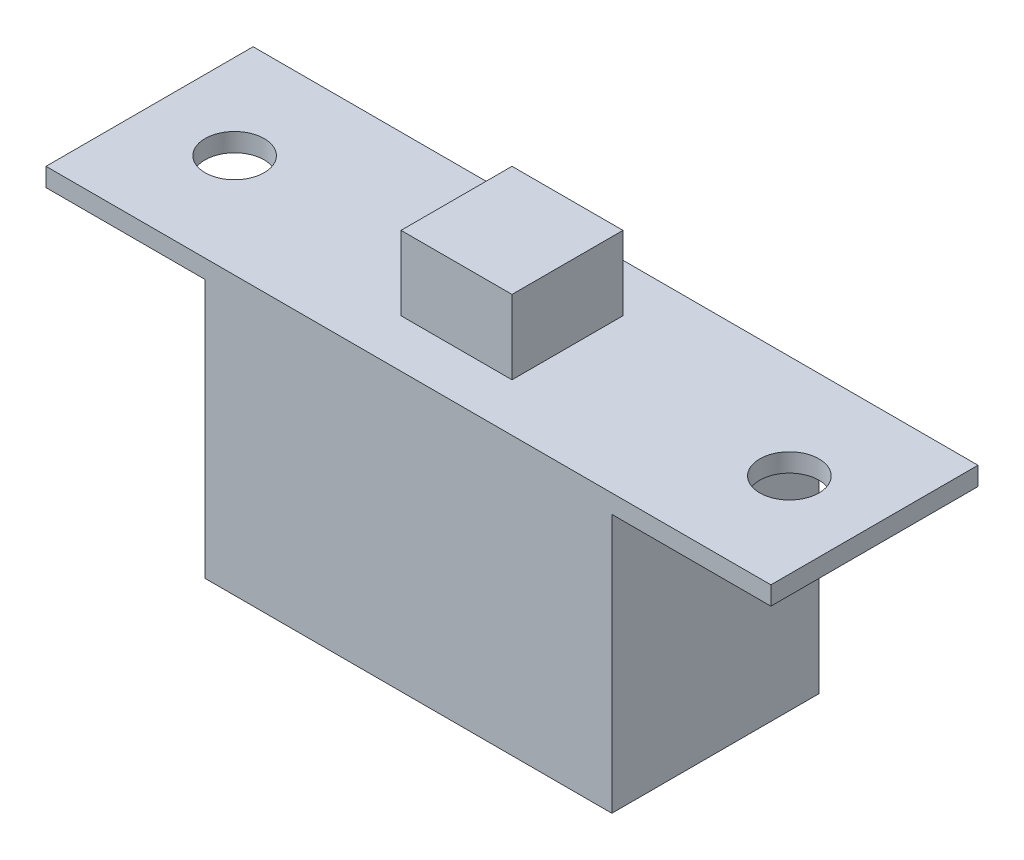
ISO-10303-21;
HEADER;
FILE_DESCRIPTION(('STEP AP214'),'2;1');
FILE_NAME('part.step','',(''),(''),'','','');
FILE_SCHEMA(('AUTOMOTIVE_DESIGN { 1 0 10303 214 1 1 1 1 }'));
ENDSEC;
DATA;
#1=APPLICATION_CONTEXT('core data for automotive mechanical design processes');
#2=APPLICATION_PROTOCOL_DEFINITION('international standard','automotive_design',2000,#1);
#3=PRODUCT_CONTEXT('',#1,'mechanical');
#4=PRODUCT('Part','Part','',(#3));
#5=PRODUCT_RELATED_PRODUCT_CATEGORY('part','',(#4));
#6=PRODUCT_DEFINITION_FORMATION('','',#4);
#7=PRODUCT_DEFINITION_CONTEXT('part definition',#1,'design');
#8=PRODUCT_DEFINITION('design','',#6,#7);
#9=PRODUCT_DEFINITION_SHAPE('','',#8);
#10=(LENGTH_UNIT() NAMED_UNIT(*) SI_UNIT(.MILLI.,.METRE.));
#11=(NAMED_UNIT(*) PLANE_ANGLE_UNIT() SI_UNIT($,.RADIAN.));
#12=(NAMED_UNIT(*) SI_UNIT($,.STERADIAN.) SOLID_ANGLE_UNIT());
#13=UNCERTAINTY_MEASURE_WITH_UNIT(LENGTH_MEASURE(1.E-05),#10,'distance_accuracy_value','');
#14=(GEOMETRIC_REPRESENTATION_CONTEXT(3) GLOBAL_UNCERTAINTY_ASSIGNED_CONTEXT((#13)) GLOBAL_UNIT_ASSIGNED_CONTEXT((#10,
#11,#12)) REPRESENTATION_CONTEXT('',''));
#15=CARTESIAN_POINT('',(0.,0.,0.));
#16=DIRECTION('',(0.,0.,1.));
#17=DIRECTION('',(1.,0.,0.));
#18=AXIS2_PLACEMENT_3D('',#15,#16,#17);
#19=CARTESIAN_POINT('',(1.5,-2.,2.8));
#20=DIRECTION('',(-1.,0.,0.));
#21=DIRECTION('',(0.,-1.,0.));
#22=AXIS2_PLACEMENT_3D('',#19,#20,#21);
#23=PLANE('',#22);
#24=DIRECTION('',(0.,1.,0.));
#25=VECTOR('',#24,1.);
#26=CARTESIAN_POINT('',(1.5,-2.,-1.5));
#27=LINE('',#26,#25);
#28=CARTESIAN_POINT('',(1.5,-2.,-1.5));
#29=VERTEX_POINT('',#28);
#30=CARTESIAN_POINT('',(1.5,0.,-1.5));
#31=VERTEX_POINT('',#30);
#32=EDGE_CURVE('E215',#29,#31,#27,.T.);
#33=ORIENTED_EDGE('',*,*,#32,.T.);
#34=DIRECTION('',(0.,0.,-1.));
#35=VECTOR('',#34,1.);
#36=CARTESIAN_POINT('',(1.5,0.,2.8));
#37=LINE('',#36,#35);
#38=CARTESIAN_POINT('',(1.5,0.,1.5));
#39=VERTEX_POINT('',#38);
#40=EDGE_CURVE('E166',#39,#31,#37,.T.);
#41=ORIENTED_EDGE('',*,*,#40,.F.);
#42=DIRECTION('',(0.,1.,0.));
#43=VECTOR('',#42,1.);
#44=CARTESIAN_POINT('',(1.5,-2.,1.5));
#45=LINE('',#44,#43);
#46=CARTESIAN_POINT('',(1.5,-2.,1.5));
#47=VERTEX_POINT('',#46);
#48=EDGE_CURVE('E203',#47,#39,#45,.T.);
#49=ORIENTED_EDGE('',*,*,#48,.F.);
#50=DIRECTION('',(0.,0.,-1.));
#51=VECTOR('',#50,1.);
#52=CARTESIAN_POINT('',(1.5,-2.,2.8));
#53=LINE('',#52,#51);
#54=EDGE_CURVE('E169',#47,#29,#53,.T.);
#55=ORIENTED_EDGE('',*,*,#54,.T.);
#56=EDGE_LOOP('',(#33,#41,#49,#55));
#57=FACE_BOUND('',#56,.T.);
#58=ADVANCED_FACE('F41',(#57),#23,.F.);
#59=CARTESIAN_POINT('',(-1.5,0.,2.8));
#60=DIRECTION('',(0.,-1.,0.));
#61=DIRECTION('',(1.,0.,0.));
#62=AXIS2_PLACEMENT_3D('',#59,#60,#61);
#63=PLANE('',#62);
#64=DIRECTION('',(-1.,0.,0.));
#65=VECTOR('',#64,1.);
#66=CARTESIAN_POINT('',(1.5,0.,-1.5));
#67=LINE('',#66,#65);
#68=CARTESIAN_POINT('',(-1.5,0.,-1.5));
#69=VERTEX_POINT('',#68);
#70=EDGE_CURVE('E218',#31,#69,#67,.T.);
#71=ORIENTED_EDGE('',*,*,#70,.T.);
#72=DIRECTION('',(0.,0.,-1.));
#73=VECTOR('',#72,1.);
#74=CARTESIAN_POINT('',(-1.5,0.,2.8));
#75=LINE('',#74,#73);
#76=CARTESIAN_POINT('',(-1.5,0.,1.5));
#77=VERTEX_POINT('',#76);
#78=EDGE_CURVE('E163',#77,#69,#75,.T.);
#79=ORIENTED_EDGE('',*,*,#78,.F.);
#80=DIRECTION('',(-1.,0.,0.));
#81=VECTOR('',#80,1.);
#82=CARTESIAN_POINT('',(1.5,0.,1.5));
#83=LINE('',#82,#81);
#84=EDGE_CURVE('E146',#39,#77,#83,.T.);
#85=ORIENTED_EDGE('',*,*,#84,.F.);
#86=ORIENTED_EDGE('',*,*,#40,.T.);
#87=EDGE_LOOP('',(#71,#79,#85,#86));
#88=FACE_BOUND('',#87,.T.);
#89=ADVANCED_FACE('F270',(#88),#63,.F.);
#90=CARTESIAN_POINT('',(-1.5,-2.,2.8));
#91=DIRECTION('',(1.,0.,0.));
#92=DIRECTION('',(0.,1.,0.));
#93=AXIS2_PLACEMENT_3D('',#90,#91,#92);
#94=PLANE('',#93);
#95=DIRECTION('',(0.,-1.,0.));
#96=VECTOR('',#95,1.);
#97=CARTESIAN_POINT('',(-1.5,-2.,-1.5));
#98=LINE('',#97,#96);
#99=CARTESIAN_POINT('',(-1.5,-2.,-1.5));
#100=VERTEX_POINT('',#99);
#101=EDGE_CURVE('E221',#69,#100,#98,.T.);
#102=ORIENTED_EDGE('',*,*,#101,.T.);
#103=DIRECTION('',(0.,0.,-1.));
#104=VECTOR('',#103,1.);
#105=CARTESIAN_POINT('',(-1.5,-2.,2.8));
#106=LINE('',#105,#104);
#107=CARTESIAN_POINT('',(-1.5,-2.,1.5));
#108=VERTEX_POINT('',#107);
#109=EDGE_CURVE('E160',#108,#100,#106,.T.);
#110=ORIENTED_EDGE('',*,*,#109,.F.);
#111=DIRECTION('',(0.,-1.,0.));
#112=VECTOR('',#111,1.);
#113=CARTESIAN_POINT('',(-1.5,-2.,1.5));
#114=LINE('',#113,#112);
#115=EDGE_CURVE('E209',#77,#108,#114,.T.);
#116=ORIENTED_EDGE('',*,*,#115,.F.);
#117=ORIENTED_EDGE('',*,*,#78,.T.);
#118=EDGE_LOOP('',(#102,#110,#116,#117));
#119=FACE_BOUND('',#118,.T.);
#120=ADVANCED_FACE('F256',(#119),#94,.F.);
#121=CARTESIAN_POINT('',(0.,0.,2.8));
#122=DIRECTION('',(0.,0.,1.));
#123=DIRECTION('',(1.,0.,0.));
#124=AXIS2_PLACEMENT_3D('',#121,#122,#123);
#125=PLANE('',#124);
#126=DIRECTION('',(-1.,0.,0.));
#127=VECTOR('',#126,1.);
#128=CARTESIAN_POINT('',(9.8,-2.,2.8));
#129=LINE('',#128,#127);
#130=CARTESIAN_POINT('',(9.8,-2.,2.8));
#131=VERTEX_POINT('',#130);
#132=CARTESIAN_POINT('',(-9.8,-2.,2.8));
#133=VERTEX_POINT('',#132);
#134=EDGE_CURVE('E58',#131,#133,#129,.T.);
#135=ORIENTED_EDGE('',*,*,#134,.T.);
#136=DIRECTION('',(0.,-1.,0.));
#137=VECTOR('',#136,1.);
#138=CARTESIAN_POINT('',(-9.8,-2.,2.8));
#139=LINE('',#138,#137);
#140=CARTESIAN_POINT('',(-9.8,-2.5,2.8));
#141=VERTEX_POINT('',#140);
#142=EDGE_CURVE('E158',#133,#141,#139,.T.);
#143=ORIENTED_EDGE('',*,*,#142,.T.);
#144=DIRECTION('',(1.,0.,0.));
#145=VECTOR('',#144,1.);
#146=CARTESIAN_POINT('',(-9.8,-2.5,2.8));
#147=LINE('',#146,#145);
#148=CARTESIAN_POINT('',(-5.5,-2.5,2.8));
#149=VERTEX_POINT('',#148);
#150=EDGE_CURVE('E100',#141,#149,#147,.T.);
#151=ORIENTED_EDGE('',*,*,#150,.T.);
#152=DIRECTION('',(0.,-1.,0.));
#153=VECTOR('',#152,1.);
#154=CARTESIAN_POINT('',(-5.5,-2.5,2.8));
#155=LINE('',#154,#153);
#156=CARTESIAN_POINT('',(-5.5,-9.5,2.8));
#157=VERTEX_POINT('',#156);
#158=EDGE_CURVE('E185',#149,#157,#155,.T.);
#159=ORIENTED_EDGE('',*,*,#158,.T.);
#160=DIRECTION('',(1.,0.,0.));
#161=VECTOR('',#160,1.);
#162=CARTESIAN_POINT('',(-5.5,-9.5,2.8));
#163=LINE('',#162,#161);
#164=CARTESIAN_POINT('',(5.5,-9.5,2.8));
#165=VERTEX_POINT('',#164);
#166=EDGE_CURVE('E195',#157,#165,#163,.T.);
#167=ORIENTED_EDGE('',*,*,#166,.T.);
#168=DIRECTION('',(0.,1.,0.));
#169=VECTOR('',#168,1.);
#170=CARTESIAN_POINT('',(5.5,-2.5,2.8));
#171=LINE('',#170,#169);
#172=CARTESIAN_POINT('',(5.5,-2.5,2.8));
#173=VERTEX_POINT('',#172);
#174=EDGE_CURVE('E122',#165,#173,#171,.T.);
#175=ORIENTED_EDGE('',*,*,#174,.T.);
#176=DIRECTION('',(1.,0.,0.));
#177=VECTOR('',#176,1.);
#178=CARTESIAN_POINT('',(9.8,-2.5,2.8));
#179=LINE('',#178,#177);
#180=CARTESIAN_POINT('',(9.8,-2.5,2.8));
#181=VERTEX_POINT('',#180);
#182=EDGE_CURVE('E115',#173,#181,#179,.T.);
#183=ORIENTED_EDGE('',*,*,#182,.T.);
#184=DIRECTION('',(0.,1.,0.));
#185=VECTOR('',#184,1.);
#186=CARTESIAN_POINT('',(9.8,-2.,2.8));
#187=LINE('',#186,#185);
#188=EDGE_CURVE('E119',#181,#131,#187,.T.);
#189=ORIENTED_EDGE('',*,*,#188,.T.);
#190=EDGE_LOOP('',(#135,#143,#151,#159,#167,#175,#183,#189));
#191=FACE_BOUND('',#190,.T.);
#192=ADVANCED_FACE('F117',(#191),#125,.T.);
#193=CARTESIAN_POINT('',(-9.8,-2.,2.8));
#194=DIRECTION('',(1.,0.,0.));
#195=DIRECTION('',(0.,0.,-1.));
#196=AXIS2_PLACEMENT_3D('',#193,#194,#195);
#197=PLANE('',#196);
#198=DIRECTION('',(0.,-1.,0.));
#199=VECTOR('',#198,1.);
#200=CARTESIAN_POINT('',(-9.8,-2.,-2.8));
#201=LINE('',#200,#199);
#202=CARTESIAN_POINT('',(-9.8,-2.,-2.8));
#203=VERTEX_POINT('',#202);
#204=CARTESIAN_POINT('',(-9.8,-2.5,-2.8));
#205=VERTEX_POINT('',#204);
#206=EDGE_CURVE('E142',#203,#205,#201,.T.);
#207=ORIENTED_EDGE('',*,*,#206,.T.);
#208=DIRECTION('',(0.,0.,-1.));
#209=VECTOR('',#208,1.);
#210=CARTESIAN_POINT('',(-9.8,-2.5,2.8));
#211=LINE('',#210,#209);
#212=EDGE_CURVE('E11',#141,#205,#211,.T.);
#213=ORIENTED_EDGE('',*,*,#212,.F.);
#214=ORIENTED_EDGE('',*,*,#142,.F.);
#215=DIRECTION('',(0.,0.,-1.));
#216=VECTOR('',#215,1.);
#217=CARTESIAN_POINT('',(-9.8,-2.,2.8));
#218=LINE('',#217,#216);
#219=EDGE_CURVE('E138',#133,#203,#218,.T.);
#220=ORIENTED_EDGE('',*,*,#219,.T.);
#221=EDGE_LOOP('',(#207,#213,#214,#220));
#222=FACE_BOUND('',#221,.T.);
#223=ADVANCED_FACE('F43',(#222),#197,.F.);
#224=CARTESIAN_POINT('',(-9.8,-2.5,2.8));
#225=DIRECTION('',(0.,1.,0.));
#226=DIRECTION('',(-1.,0.,0.));
#227=AXIS2_PLACEMENT_3D('',#224,#225,#226);
#228=PLANE('',#227);
#229=CARTESIAN_POINT('',(-7.5,-2.5,0.));
#230=DIRECTION('',(0.,1.,0.));
#231=DIRECTION('',(-1.,0.,0.));
#232=AXIS2_PLACEMENT_3D('',#229,#230,#231);
#233=CIRCLE('',#232,0.799999999999999);
#234=CARTESIAN_POINT('',(-8.3,-2.5,0.));
#235=VERTEX_POINT('',#234);
#236=EDGE_CURVE('E230',#235,#235,#233,.T.);
#237=ORIENTED_EDGE('',*,*,#236,.T.);
#238=EDGE_LOOP('',(#237));
#239=FACE_BOUND('',#238,.T.);
#240=DIRECTION('',(1.,0.,0.));
#241=VECTOR('',#240,1.);
#242=CARTESIAN_POINT('',(-9.8,-2.5,-2.8));
#243=LINE('',#242,#241);
#244=CARTESIAN_POINT('',(-5.5,-2.5,-2.8));
#245=VERTEX_POINT('',#244);
#246=EDGE_CURVE('E145',#205,#245,#243,.T.);
#247=ORIENTED_EDGE('',*,*,#246,.T.);
#248=DIRECTION('',(0.,0.,-1.));
#249=VECTOR('',#248,1.);
#250=CARTESIAN_POINT('',(-5.5,-2.5,2.8));
#251=LINE('',#250,#249);
#252=EDGE_CURVE('E50',#149,#245,#251,.T.);
#253=ORIENTED_EDGE('',*,*,#252,.F.);
#254=ORIENTED_EDGE('',*,*,#150,.F.);
#255=ORIENTED_EDGE('',*,*,#212,.T.);
#256=EDGE_LOOP('',(#247,#253,#254,#255));
#257=FACE_BOUND('',#256,.T.);
#258=ADVANCED_FACE('F308',(#239,#257),#228,.F.);
#259=CARTESIAN_POINT('',(-5.5,-2.5,2.8));
#260=DIRECTION('',(1.,0.,0.));
#261=DIRECTION('',(0.,1.,0.));
#262=AXIS2_PLACEMENT_3D('',#259,#260,#261);
#263=PLANE('',#262);
#264=DIRECTION('',(0.,-1.,0.));
#265=VECTOR('',#264,1.);
#266=CARTESIAN_POINT('',(-5.5,-2.5,-2.8));
#267=LINE('',#266,#265);
#268=CARTESIAN_POINT('',(-5.5,-9.5,-2.8));
#269=VERTEX_POINT('',#268);
#270=EDGE_CURVE('E148',#245,#269,#267,.T.);
#271=ORIENTED_EDGE('',*,*,#270,.T.);
#272=DIRECTION('',(0.,0.,-1.));
#273=VECTOR('',#272,1.);
#274=CARTESIAN_POINT('',(-5.5,-9.5,2.8));
#275=LINE('',#274,#273);
#276=EDGE_CURVE('E177',#157,#269,#275,.T.);
#277=ORIENTED_EDGE('',*,*,#276,.F.);
#278=ORIENTED_EDGE('',*,*,#158,.F.);
#279=ORIENTED_EDGE('',*,*,#252,.T.);
#280=EDGE_LOOP('',(#271,#277,#278,#279));
#281=FACE_BOUND('',#280,.T.);
#282=ADVANCED_FACE('F183',(#281),#263,.F.);
#283=CARTESIAN_POINT('',(-5.5,-9.5,2.8));
#284=DIRECTION('',(0.,1.,0.));
#285=DIRECTION('',(-1.,0.,0.));
#286=AXIS2_PLACEMENT_3D('',#283,#284,#285);
#287=PLANE('',#286);
#288=DIRECTION('',(1.,0.,0.));
#289=VECTOR('',#288,1.);
#290=CARTESIAN_POINT('',(-5.5,-9.5,-2.8));
#291=LINE('',#290,#289);
#292=CARTESIAN_POINT('',(5.5,-9.5,-2.8));
#293=VERTEX_POINT('',#292);
#294=EDGE_CURVE('E150',#269,#293,#291,.T.);
#295=ORIENTED_EDGE('',*,*,#294,.T.);
#296=DIRECTION('',(0.,0.,-1.));
#297=VECTOR('',#296,1.);
#298=CARTESIAN_POINT('',(5.5,-9.5,2.8));
#299=LINE('',#298,#297);
#300=EDGE_CURVE('E174',#165,#293,#299,.T.);
#301=ORIENTED_EDGE('',*,*,#300,.F.);
#302=ORIENTED_EDGE('',*,*,#166,.F.);
#303=ORIENTED_EDGE('',*,*,#276,.T.);
#304=EDGE_LOOP('',(#295,#301,#302,#303));
#305=FACE_BOUND('',#304,.T.);
#306=ADVANCED_FACE('F191',(#305),#287,.F.);
#307=CARTESIAN_POINT('',(5.5,-2.5,2.8));
#308=DIRECTION('',(-1.,0.,0.));
#309=DIRECTION('',(0.,-1.,0.));
#310=AXIS2_PLACEMENT_3D('',#307,#308,#309);
#311=PLANE('',#310);
#312=DIRECTION('',(0.,1.,0.));
#313=VECTOR('',#312,1.);
#314=CARTESIAN_POINT('',(5.5,-2.5,-2.8));
#315=LINE('',#314,#313);
#316=CARTESIAN_POINT('',(5.5,-2.5,-2.8));
#317=VERTEX_POINT('',#316);
#318=EDGE_CURVE('E152',#293,#317,#315,.T.);
#319=ORIENTED_EDGE('',*,*,#318,.T.);
#320=DIRECTION('',(0.,0.,-1.));
#321=VECTOR('',#320,1.);
#322=CARTESIAN_POINT('',(5.5,-2.5,2.8));
#323=LINE('',#322,#321);
#324=EDGE_CURVE('E133',#173,#317,#323,.T.);
#325=ORIENTED_EDGE('',*,*,#324,.F.);
#326=ORIENTED_EDGE('',*,*,#174,.F.);
#327=ORIENTED_EDGE('',*,*,#300,.T.);
#328=EDGE_LOOP('',(#319,#325,#326,#327));
#329=FACE_BOUND('',#328,.T.);
#330=ADVANCED_FACE('F194',(#329),#311,.F.);
#331=CARTESIAN_POINT('',(9.8,-2.5,2.8));
#332=DIRECTION('',(0.,1.,0.));
#333=DIRECTION('',(-1.,0.,0.));
#334=AXIS2_PLACEMENT_3D('',#331,#332,#333);
#335=PLANE('',#334);
#336=CARTESIAN_POINT('',(7.5,-2.5,0.));
#337=DIRECTION('',(0.,1.,0.));
#338=DIRECTION('',(-1.,0.,0.));
#339=AXIS2_PLACEMENT_3D('',#336,#337,#338);
#340=CIRCLE('',#339,0.799999999999999);
#341=CARTESIAN_POINT('',(6.7,-2.5,0.));
#342=VERTEX_POINT('',#341);
#343=EDGE_CURVE('E224',#342,#342,#340,.T.);
#344=ORIENTED_EDGE('',*,*,#343,.T.);
#345=EDGE_LOOP('',(#344));
#346=FACE_BOUND('',#345,.T.);
#347=DIRECTION('',(1.,0.,0.));
#348=VECTOR('',#347,1.);
#349=CARTESIAN_POINT('',(9.8,-2.5,-2.8));
#350=LINE('',#349,#348);
#351=CARTESIAN_POINT('',(9.8,-2.5,-2.8));
#352=VERTEX_POINT('',#351);
#353=EDGE_CURVE('E131',#317,#352,#350,.T.);
#354=ORIENTED_EDGE('',*,*,#353,.T.);
#355=DIRECTION('',(0.,0.,-1.));
#356=VECTOR('',#355,1.);
#357=CARTESIAN_POINT('',(9.8,-2.5,2.8));
#358=LINE('',#357,#356);
#359=EDGE_CURVE('E128',#181,#352,#358,.T.);
#360=ORIENTED_EDGE('',*,*,#359,.F.);
#361=ORIENTED_EDGE('',*,*,#182,.F.);
#362=ORIENTED_EDGE('',*,*,#324,.T.);
#363=EDGE_LOOP('',(#354,#360,#361,#362));
#364=FACE_BOUND('',#363,.T.);
#365=ADVANCED_FACE('F129',(#346,#364),#335,.F.);
#366=CARTESIAN_POINT('',(9.8,-2.,2.8));
#367=DIRECTION('',(-1.,0.,0.));
#368=DIRECTION('',(0.,-1.,0.));
#369=AXIS2_PLACEMENT_3D('',#366,#367,#368);
#370=PLANE('',#369);
#371=DIRECTION('',(0.,1.,0.));
#372=VECTOR('',#371,1.);
#373=CARTESIAN_POINT('',(9.8,-2.,-2.8));
#374=LINE('',#373,#372);
#375=CARTESIAN_POINT('',(9.8,-2.,-2.8));
#376=VERTEX_POINT('',#375);
#377=EDGE_CURVE('E155',#352,#376,#374,.T.);
#378=ORIENTED_EDGE('',*,*,#377,.T.);
#379=DIRECTION('',(0.,0.,-1.));
#380=VECTOR('',#379,1.);
#381=CARTESIAN_POINT('',(9.8,-2.,2.8));
#382=LINE('',#381,#380);
#383=EDGE_CURVE('E134',#131,#376,#382,.T.);
#384=ORIENTED_EDGE('',*,*,#383,.F.);
#385=ORIENTED_EDGE('',*,*,#188,.F.);
#386=ORIENTED_EDGE('',*,*,#359,.T.);
#387=EDGE_LOOP('',(#378,#384,#385,#386));
#388=FACE_BOUND('',#387,.T.);
#389=ADVANCED_FACE('F136',(#388),#370,.F.);
#390=CARTESIAN_POINT('',(-9.8,-2.,2.8));
#391=DIRECTION('',(0.,-1.,0.));
#392=DIRECTION('',(1.,0.,0.));
#393=AXIS2_PLACEMENT_3D('',#390,#391,#392);
#394=PLANE('',#393);
#395=CARTESIAN_POINT('',(-7.5,-2.,0.));
#396=DIRECTION('',(0.,1.,0.));
#397=DIRECTION('',(0.,0.,1.));
#398=AXIS2_PLACEMENT_3D('',#395,#396,#397);
#399=CIRCLE('',#398,0.799999999999999);
#400=CARTESIAN_POINT('',(-7.5,-2.,0.799999999999999));
#401=VERTEX_POINT('',#400);
#402=EDGE_CURVE('E233',#401,#401,#399,.T.);
#403=ORIENTED_EDGE('',*,*,#402,.F.);
#404=EDGE_LOOP('',(#403));
#405=FACE_BOUND('',#404,.T.);
#406=CARTESIAN_POINT('',(7.5,-2.,0.));
#407=DIRECTION('',(0.,1.,0.));
#408=DIRECTION('',(0.,0.,1.));
#409=AXIS2_PLACEMENT_3D('',#406,#407,#408);
#410=CIRCLE('',#409,0.799999999999999);
#411=CARTESIAN_POINT('',(7.5,-2.,0.799999999999999));
#412=VERTEX_POINT('',#411);
#413=EDGE_CURVE('E227',#412,#412,#410,.T.);
#414=ORIENTED_EDGE('',*,*,#413,.F.);
#415=EDGE_LOOP('',(#414));
#416=FACE_BOUND('',#415,.T.);
#417=ORIENTED_EDGE('',*,*,#109,.T.);
#418=DIRECTION('',(1.,0.,0.));
#419=VECTOR('',#418,1.);
#420=CARTESIAN_POINT('',(1.5,-2.,-1.5));
#421=LINE('',#420,#419);
#422=EDGE_CURVE('E212',#100,#29,#421,.T.);
#423=ORIENTED_EDGE('',*,*,#422,.T.);
#424=ORIENTED_EDGE('',*,*,#54,.F.);
#425=DIRECTION('',(1.,0.,0.));
#426=VECTOR('',#425,1.);
#427=CARTESIAN_POINT('',(1.5,-2.,1.5));
#428=LINE('',#427,#426);
#429=EDGE_CURVE('E206',#108,#47,#428,.T.);
#430=ORIENTED_EDGE('',*,*,#429,.F.);
#431=EDGE_LOOP('',(#417,#423,#424,#430));
#432=FACE_BOUND('',#431,.T.);
#433=DIRECTION('',(-1.,0.,0.));
#434=VECTOR('',#433,1.);
#435=CARTESIAN_POINT('',(-9.8,-2.,-2.8));
#436=LINE('',#435,#434);
#437=EDGE_CURVE('E88',#376,#203,#436,.T.);
#438=ORIENTED_EDGE('',*,*,#437,.T.);
#439=ORIENTED_EDGE('',*,*,#219,.F.);
#440=ORIENTED_EDGE('',*,*,#134,.F.);
#441=ORIENTED_EDGE('',*,*,#383,.T.);
#442=EDGE_LOOP('',(#438,#439,#440,#441));
#443=FACE_BOUND('',#442,.T.);
#444=ADVANCED_FACE('F240',(#405,#416,#432,#443),#394,.F.);
#445=CARTESIAN_POINT('',(0.,0.,-2.8));
#446=DIRECTION('',(0.,0.,1.));
#447=DIRECTION('',(1.,0.,0.));
#448=AXIS2_PLACEMENT_3D('',#445,#446,#447);
#449=PLANE('',#448);
#450=ORIENTED_EDGE('',*,*,#437,.F.);
#451=ORIENTED_EDGE('',*,*,#377,.F.);
#452=ORIENTED_EDGE('',*,*,#353,.F.);
#453=ORIENTED_EDGE('',*,*,#318,.F.);
#454=ORIENTED_EDGE('',*,*,#294,.F.);
#455=ORIENTED_EDGE('',*,*,#270,.F.);
#456=ORIENTED_EDGE('',*,*,#246,.F.);
#457=ORIENTED_EDGE('',*,*,#206,.F.);
#458=EDGE_LOOP('',(#450,#451,#452,#453,#454,#455,#456,#457));
#459=FACE_BOUND('',#458,.T.);
#460=ADVANCED_FACE('F187',(#459),#449,.F.);
#461=CARTESIAN_POINT('',(0.,0.,1.5));
#462=DIRECTION('',(0.,0.,1.));
#463=DIRECTION('',(1.,0.,0.));
#464=AXIS2_PLACEMENT_3D('',#461,#462,#463);
#465=PLANE('',#464);
#466=ORIENTED_EDGE('',*,*,#115,.T.);
#467=ORIENTED_EDGE('',*,*,#429,.T.);
#468=ORIENTED_EDGE('',*,*,#48,.T.);
#469=ORIENTED_EDGE('',*,*,#84,.T.);
#470=EDGE_LOOP('',(#466,#467,#468,#469));
#471=FACE_BOUND('',#470,.T.);
#472=ADVANCED_FACE('F267',(#471),#465,.T.);
#473=CARTESIAN_POINT('',(0.,0.,-1.5));
#474=DIRECTION('',(0.,0.,-1.));
#475=DIRECTION('',(1.,0.,0.));
#476=AXIS2_PLACEMENT_3D('',#473,#474,#475);
#477=PLANE('',#476);
#478=ORIENTED_EDGE('',*,*,#101,.F.);
#479=ORIENTED_EDGE('',*,*,#70,.F.);
#480=ORIENTED_EDGE('',*,*,#32,.F.);
#481=ORIENTED_EDGE('',*,*,#422,.F.);
#482=EDGE_LOOP('',(#478,#479,#480,#481));
#483=FACE_BOUND('',#482,.T.);
#484=ADVANCED_FACE('F278',(#483),#477,.T.);
#485=CARTESIAN_POINT('',(7.5,-2.,0.));
#486=DIRECTION('',(0.,1.,0.));
#487=DIRECTION('',(0.,0.,1.));
#488=AXIS2_PLACEMENT_3D('',#485,#486,#487);
#489=CYLINDRICAL_SURFACE('',#488,0.799999999999999);
#490=ORIENTED_EDGE('',*,*,#413,.T.);
#491=EDGE_LOOP('',(#490));
#492=FACE_BOUND('',#491,.T.);
#493=ORIENTED_EDGE('',*,*,#343,.F.);
#494=EDGE_LOOP('',(#493));
#495=FACE_BOUND('',#494,.T.);
#496=ADVANCED_FACE('F281',(#492,#495),#489,.F.);
#497=CARTESIAN_POINT('',(-7.5,-2.,0.));
#498=DIRECTION('',(0.,1.,0.));
#499=DIRECTION('',(0.,0.,1.));
#500=AXIS2_PLACEMENT_3D('',#497,#498,#499);
#501=CYLINDRICAL_SURFACE('',#500,0.799999999999999);
#502=ORIENTED_EDGE('',*,*,#402,.T.);
#503=EDGE_LOOP('',(#502));
#504=FACE_BOUND('',#503,.T.);
#505=ORIENTED_EDGE('',*,*,#236,.F.);
#506=EDGE_LOOP('',(#505));
#507=FACE_BOUND('',#506,.T.);
#508=ADVANCED_FACE('F237',(#504,#507),#501,.F.);
#509=CLOSED_SHELL('',(#58,#89,#120,#192,#223,#258,#282,#306,#330,#365,#389,#444,#460,#472,#484,
#496,#508));
#510=MANIFOLD_SOLID_BREP('B2',#509);
#511=ADVANCED_BREP_SHAPE_REPRESENTATION('',(#18,#510),#14);
#512=SHAPE_DEFINITION_REPRESENTATION(#9,#511);
ENDSEC;
END-ISO-10303-21;
